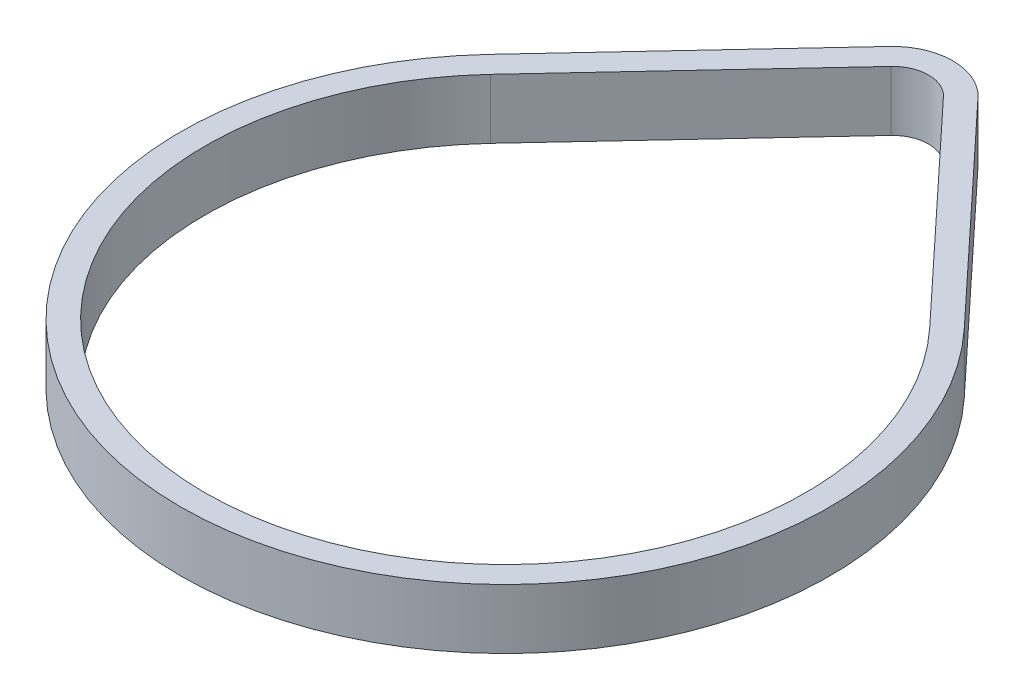
ISO-10303-21;
HEADER;
FILE_DESCRIPTION(('STEP AP214'),'2;1');
FILE_NAME('part.step','',(''),(''),'','','');
FILE_SCHEMA(('AUTOMOTIVE_DESIGN { 1 0 10303 214 1 1 1 1 }'));
ENDSEC;
DATA;
#1=APPLICATION_CONTEXT('core data for automotive mechanical design processes');
#2=APPLICATION_PROTOCOL_DEFINITION('international standard','automotive_design',2000,#1);
#3=PRODUCT_CONTEXT('',#1,'mechanical');
#4=PRODUCT('Part','Part','',(#3));
#5=PRODUCT_RELATED_PRODUCT_CATEGORY('part','',(#4));
#6=PRODUCT_DEFINITION_FORMATION('','',#4);
#7=PRODUCT_DEFINITION_CONTEXT('part definition',#1,'design');
#8=PRODUCT_DEFINITION('design','',#6,#7);
#9=PRODUCT_DEFINITION_SHAPE('','',#8);
#10=(LENGTH_UNIT() NAMED_UNIT(*) SI_UNIT(.MILLI.,.METRE.));
#11=(NAMED_UNIT(*) PLANE_ANGLE_UNIT() SI_UNIT($,.RADIAN.));
#12=(NAMED_UNIT(*) SI_UNIT($,.STERADIAN.) SOLID_ANGLE_UNIT());
#13=UNCERTAINTY_MEASURE_WITH_UNIT(LENGTH_MEASURE(1.E-05),#10,'distance_accuracy_value','');
#14=(GEOMETRIC_REPRESENTATION_CONTEXT(3) GLOBAL_UNCERTAINTY_ASSIGNED_CONTEXT((#13)) GLOBAL_UNIT_ASSIGNED_CONTEXT((#10,
#11,#12)) REPRESENTATION_CONTEXT('',''));
#15=CARTESIAN_POINT('',(0.,0.,0.));
#16=DIRECTION('',(0.,0.,1.));
#17=DIRECTION('',(1.,0.,0.));
#18=AXIS2_PLACEMENT_3D('',#15,#16,#17);
#19=CARTESIAN_POINT('',(0.,4.5,-58.3013119830021));
#20=DIRECTION('',(0.,1.,0.));
#21=DIRECTION('',(0.,0.,1.));
#22=AXIS2_PLACEMENT_3D('',#19,#20,#21);
#23=PLANE('',#22);
#24=CARTESIAN_POINT('',(0.,4.5,-58.3013119830021));
#25=DIRECTION('',(0.,1.,0.));
#26=DIRECTION('',(1.,0.,0.));
#27=AXIS2_PLACEMENT_3D('',#24,#25,#26);
#28=CIRCLE('',#27,9.1007472071159);
#29=CARTESIAN_POINT('',(6.65188338711861,4.5,-64.512273835405));
#30=VERTEX_POINT('',#29);
#31=CARTESIAN_POINT('',(-6.65188338711861,4.5,-64.512273835405));
#32=VERTEX_POINT('',#31);
#33=EDGE_CURVE('E117',#30,#32,#28,.T.);
#34=ORIENTED_EDGE('',*,*,#33,.T.);
#35=DIRECTION('',(-0.682467242639865,0.,0.730916180367859));
#36=VECTOR('',#35,1.);
#37=CARTESIAN_POINT('',(-6.65188338711861,4.5,-64.512273835405));
#38=LINE('',#37,#36);
#39=CARTESIAN_POINT('',(-35.7341140564339,4.5,-33.3654705468403));
#40=VERTEX_POINT('',#39);
#41=EDGE_CURVE('E120',#32,#40,#38,.T.);
#42=ORIENTED_EDGE('',*,*,#41,.T.);
#43=CARTESIAN_POINT('',(0.,4.5,0.));
#44=DIRECTION('',(0.,1.,0.));
#45=DIRECTION('',(1.,0.,0.));
#46=AXIS2_PLACEMENT_3D('',#43,#44,#45);
#47=CIRCLE('',#46,48.8894828384418);
#48=CARTESIAN_POINT('',(35.7341140564339,4.5,-33.3654705468403));
#49=VERTEX_POINT('',#48);
#50=EDGE_CURVE('E123',#40,#49,#47,.T.);
#51=ORIENTED_EDGE('',*,*,#50,.T.);
#52=DIRECTION('',(-0.682467242639864,0.,-0.730916180367859));
#53=VECTOR('',#52,1.);
#54=CARTESIAN_POINT('',(6.65188338711861,4.5,-64.512273835405));
#55=LINE('',#54,#53);
#56=EDGE_CURVE('E125',#49,#30,#55,.T.);
#57=ORIENTED_EDGE('',*,*,#56,.T.);
#58=EDGE_LOOP('',(#34,#42,#51,#57));
#59=FACE_BOUND('',#58,.T.);
#60=DIRECTION('',(-0.682467242639865,0.,0.730916180367859));
#61=VECTOR('',#60,1.);
#62=CARTESIAN_POINT('',(-3.95991909482379,4.5,-61.9987469807623));
#63=LINE('',#62,#61);
#64=CARTESIAN_POINT('',(-3.95991909482379,4.5,-61.9987469807623));
#65=VERTEX_POINT('',#64);
#66=CARTESIAN_POINT('',(-33.0421497641391,4.5,-30.8519436921978));
#67=VERTEX_POINT('',#66);
#68=EDGE_CURVE('E89',#65,#67,#63,.T.);
#69=ORIENTED_EDGE('',*,*,#68,.F.);
#70=CARTESIAN_POINT('',(0.,4.5,-58.3013119830021));
#71=DIRECTION('',(0.,1.,0.));
#72=DIRECTION('',(1.,0.,0.));
#73=AXIS2_PLACEMENT_3D('',#70,#71,#72);
#74=CIRCLE('',#73,5.4177472071159);
#75=CARTESIAN_POINT('',(3.95991909482378,4.5,-61.9987469807624));
#76=VERTEX_POINT('',#75);
#77=EDGE_CURVE('E81',#76,#65,#74,.T.);
#78=ORIENTED_EDGE('',*,*,#77,.F.);
#79=DIRECTION('',(-0.682467242639864,0.,-0.730916180367859));
#80=VECTOR('',#79,1.);
#81=CARTESIAN_POINT('',(3.95991909482378,4.5,-61.9987469807624));
#82=LINE('',#81,#80);
#83=CARTESIAN_POINT('',(33.0421497641391,4.5,-30.8519436921978));
#84=VERTEX_POINT('',#83);
#85=EDGE_CURVE('E103',#84,#76,#82,.T.);
#86=ORIENTED_EDGE('',*,*,#85,.F.);
#87=CARTESIAN_POINT('',(0.,4.5,0.));
#88=DIRECTION('',(0.,1.,0.));
#89=DIRECTION('',(1.,0.,0.));
#90=AXIS2_PLACEMENT_3D('',#87,#88,#89);
#91=CIRCLE('',#90,45.2064828384418);
#92=EDGE_CURVE('E101',#67,#84,#91,.T.);
#93=ORIENTED_EDGE('',*,*,#92,.F.);
#94=EDGE_LOOP('',(#69,#78,#86,#93));
#95=FACE_BOUND('',#94,.T.);
#96=ADVANCED_FACE('F16',(#59,#95),#23,.T.);
#97=CARTESIAN_POINT('',(0.,-4.5,-58.3013119830021));
#98=DIRECTION('',(0.,1.,0.));
#99=DIRECTION('',(0.,0.,1.));
#100=AXIS2_PLACEMENT_3D('',#97,#98,#99);
#101=PLANE('',#100);
#102=CARTESIAN_POINT('',(0.,-4.5,-58.3013119830021));
#103=DIRECTION('',(0.,1.,0.));
#104=DIRECTION('',(1.,0.,0.));
#105=AXIS2_PLACEMENT_3D('',#102,#103,#104);
#106=CIRCLE('',#105,9.1007472071159);
#107=CARTESIAN_POINT('',(6.65188338711861,-4.5,-64.512273835405));
#108=VERTEX_POINT('',#107);
#109=CARTESIAN_POINT('',(-6.65188338711861,-4.5,-64.512273835405));
#110=VERTEX_POINT('',#109);
#111=EDGE_CURVE('E97',#108,#110,#106,.T.);
#112=ORIENTED_EDGE('',*,*,#111,.F.);
#113=DIRECTION('',(-0.682467242639864,0.,-0.730916180367859));
#114=VECTOR('',#113,1.);
#115=CARTESIAN_POINT('',(6.65188338711861,-4.5,-64.512273835405));
#116=LINE('',#115,#114);
#117=CARTESIAN_POINT('',(35.7341140564339,-4.5,-33.3654705468403));
#118=VERTEX_POINT('',#117);
#119=EDGE_CURVE('E121',#118,#108,#116,.T.);
#120=ORIENTED_EDGE('',*,*,#119,.F.);
#121=CARTESIAN_POINT('',(0.,-4.5,0.));
#122=DIRECTION('',(0.,1.,0.));
#123=DIRECTION('',(1.,0.,0.));
#124=AXIS2_PLACEMENT_3D('',#121,#122,#123);
#125=CIRCLE('',#124,48.8894828384418);
#126=CARTESIAN_POINT('',(-35.7341140564339,-4.5,-33.3654705468403));
#127=VERTEX_POINT('',#126);
#128=EDGE_CURVE('E132',#127,#118,#125,.T.);
#129=ORIENTED_EDGE('',*,*,#128,.F.);
#130=DIRECTION('',(-0.682467242639865,0.,0.730916180367859));
#131=VECTOR('',#130,1.);
#132=CARTESIAN_POINT('',(-6.65188338711861,-4.5,-64.512273835405));
#133=LINE('',#132,#131);
#134=EDGE_CURVE('E130',#110,#127,#133,.T.);
#135=ORIENTED_EDGE('',*,*,#134,.F.);
#136=EDGE_LOOP('',(#112,#120,#129,#135));
#137=FACE_BOUND('',#136,.T.);
#138=CARTESIAN_POINT('',(0.,-4.5,-58.3013119830021));
#139=DIRECTION('',(0.,1.,0.));
#140=DIRECTION('',(1.,0.,0.));
#141=AXIS2_PLACEMENT_3D('',#138,#139,#140);
#142=CIRCLE('',#141,5.4177472071159);
#143=CARTESIAN_POINT('',(3.95991909482379,-4.5,-61.9987469807624));
#144=VERTEX_POINT('',#143);
#145=CARTESIAN_POINT('',(-3.95991909482379,-4.5,-61.9987469807623));
#146=VERTEX_POINT('',#145);
#147=EDGE_CURVE('E39',#144,#146,#142,.T.);
#148=ORIENTED_EDGE('',*,*,#147,.T.);
#149=DIRECTION('',(-0.682467242639865,0.,0.730916180367859));
#150=VECTOR('',#149,1.);
#151=CARTESIAN_POINT('',(-3.95991909482379,-4.5,-61.9987469807623));
#152=LINE('',#151,#150);
#153=CARTESIAN_POINT('',(-33.0421497641391,-4.5,-30.8519436921978));
#154=VERTEX_POINT('',#153);
#155=EDGE_CURVE('E96',#146,#154,#152,.T.);
#156=ORIENTED_EDGE('',*,*,#155,.T.);
#157=CARTESIAN_POINT('',(0.,-4.5,0.));
#158=DIRECTION('',(0.,1.,0.));
#159=DIRECTION('',(1.,0.,0.));
#160=AXIS2_PLACEMENT_3D('',#157,#158,#159);
#161=CIRCLE('',#160,45.2064828384418);
#162=CARTESIAN_POINT('',(33.0421497641391,-4.5,-30.8519436921978));
#163=VERTEX_POINT('',#162);
#164=EDGE_CURVE('E109',#154,#163,#161,.T.);
#165=ORIENTED_EDGE('',*,*,#164,.T.);
#166=DIRECTION('',(-0.682467242639864,0.,-0.730916180367859));
#167=VECTOR('',#166,1.);
#168=CARTESIAN_POINT('',(3.95991909482378,-4.5,-61.9987469807624));
#169=LINE('',#168,#167);
#170=EDGE_CURVE('E90',#163,#144,#169,.T.);
#171=ORIENTED_EDGE('',*,*,#170,.T.);
#172=EDGE_LOOP('',(#148,#156,#165,#171));
#173=FACE_BOUND('',#172,.T.);
#174=ADVANCED_FACE('F150',(#137,#173),#101,.F.);
#175=CARTESIAN_POINT('',(0.,4.5,-58.3013119830021));
#176=DIRECTION('',(0.,-1.,0.));
#177=DIRECTION('',(0.,0.,-1.));
#178=AXIS2_PLACEMENT_3D('',#175,#176,#177);
#179=CYLINDRICAL_SURFACE('',#178,9.1007472071159);
#180=ORIENTED_EDGE('',*,*,#111,.T.);
#181=DIRECTION('',(0.,-1.,0.));
#182=VECTOR('',#181,1.);
#183=CARTESIAN_POINT('',(-6.65188338711861,4.5,-64.512273835405));
#184=LINE('',#183,#182);
#185=EDGE_CURVE('E11',#32,#110,#184,.T.);
#186=ORIENTED_EDGE('',*,*,#185,.F.);
#187=ORIENTED_EDGE('',*,*,#33,.F.);
#188=DIRECTION('',(0.,-1.,0.));
#189=VECTOR('',#188,1.);
#190=CARTESIAN_POINT('',(6.65188338711861,4.5,-64.512273835405));
#191=LINE('',#190,#189);
#192=EDGE_CURVE('E127',#30,#108,#191,.T.);
#193=ORIENTED_EDGE('',*,*,#192,.T.);
#194=EDGE_LOOP('',(#180,#186,#187,#193));
#195=FACE_BOUND('',#194,.T.);
#196=ADVANCED_FACE('F18',(#195),#179,.T.);
#197=CARTESIAN_POINT('',(-6.65188338711861,4.5,-64.512273835405));
#198=DIRECTION('',(0.730916180367859,0.,0.682467242639864));
#199=DIRECTION('',(0.682467242639865,0.,-0.730916180367859));
#200=AXIS2_PLACEMENT_3D('',#197,#198,#199);
#201=PLANE('',#200);
#202=ORIENTED_EDGE('',*,*,#134,.T.);
#203=DIRECTION('',(0.,-1.,0.));
#204=VECTOR('',#203,1.);
#205=CARTESIAN_POINT('',(-35.7341140564339,4.5,-33.3654705468403));
#206=LINE('',#205,#204);
#207=EDGE_CURVE('E24',#40,#127,#206,.T.);
#208=ORIENTED_EDGE('',*,*,#207,.F.);
#209=ORIENTED_EDGE('',*,*,#41,.F.);
#210=ORIENTED_EDGE('',*,*,#185,.T.);
#211=EDGE_LOOP('',(#202,#208,#209,#210));
#212=FACE_BOUND('',#211,.T.);
#213=ADVANCED_FACE('F160',(#212),#201,.F.);
#214=CARTESIAN_POINT('',(0.,4.5,0.));
#215=DIRECTION('',(0.,-1.,0.));
#216=DIRECTION('',(0.,0.,-1.));
#217=AXIS2_PLACEMENT_3D('',#214,#215,#216);
#218=CYLINDRICAL_SURFACE('',#217,48.8894828384418);
#219=ORIENTED_EDGE('',*,*,#128,.T.);
#220=DIRECTION('',(0.,-1.,0.));
#221=VECTOR('',#220,1.);
#222=CARTESIAN_POINT('',(35.7341140564339,4.5,-33.3654705468403));
#223=LINE('',#222,#221);
#224=EDGE_CURVE('E137',#49,#118,#223,.T.);
#225=ORIENTED_EDGE('',*,*,#224,.F.);
#226=ORIENTED_EDGE('',*,*,#50,.F.);
#227=ORIENTED_EDGE('',*,*,#207,.T.);
#228=EDGE_LOOP('',(#219,#225,#226,#227));
#229=FACE_BOUND('',#228,.T.);
#230=ADVANCED_FACE('F144',(#229),#218,.T.);
#231=CARTESIAN_POINT('',(6.65188338711861,4.5,-64.512273835405));
#232=DIRECTION('',(-0.730916180367859,0.,0.682467242639864));
#233=DIRECTION('',(0.682467242639864,0.,0.730916180367859));
#234=AXIS2_PLACEMENT_3D('',#231,#232,#233);
#235=PLANE('',#234);
#236=ORIENTED_EDGE('',*,*,#119,.T.);
#237=ORIENTED_EDGE('',*,*,#192,.F.);
#238=ORIENTED_EDGE('',*,*,#56,.F.);
#239=ORIENTED_EDGE('',*,*,#224,.T.);
#240=EDGE_LOOP('',(#236,#237,#238,#239));
#241=FACE_BOUND('',#240,.T.);
#242=ADVANCED_FACE('F154',(#241),#235,.F.);
#243=CARTESIAN_POINT('',(0.,4.5,-58.3013119830021));
#244=DIRECTION('',(0.,-1.,0.));
#245=DIRECTION('',(0.,0.,-1.));
#246=AXIS2_PLACEMENT_3D('',#243,#244,#245);
#247=CYLINDRICAL_SURFACE('',#246,5.4177472071159);
#248=ORIENTED_EDGE('',*,*,#147,.F.);
#249=DIRECTION('',(0.,-1.,0.));
#250=VECTOR('',#249,1.);
#251=CARTESIAN_POINT('',(3.95991909482378,4.5,-61.9987469807624));
#252=LINE('',#251,#250);
#253=EDGE_CURVE('E85',#76,#144,#252,.T.);
#254=ORIENTED_EDGE('',*,*,#253,.F.);
#255=ORIENTED_EDGE('',*,*,#77,.T.);
#256=DIRECTION('',(0.,-1.,0.));
#257=VECTOR('',#256,1.);
#258=CARTESIAN_POINT('',(-3.95991909482379,4.5,-61.9987469807623));
#259=LINE('',#258,#257);
#260=EDGE_CURVE('E84',#65,#146,#259,.T.);
#261=ORIENTED_EDGE('',*,*,#260,.T.);
#262=EDGE_LOOP('',(#248,#254,#255,#261));
#263=FACE_BOUND('',#262,.T.);
#264=ADVANCED_FACE('F83',(#263),#247,.F.);
#265=CARTESIAN_POINT('',(-3.95991909482379,4.5,-61.9987469807623));
#266=DIRECTION('',(0.730916180367859,0.,0.682467242639864));
#267=DIRECTION('',(0.682467242639865,0.,-0.730916180367859));
#268=AXIS2_PLACEMENT_3D('',#265,#266,#267);
#269=PLANE('',#268);
#270=ORIENTED_EDGE('',*,*,#155,.F.);
#271=ORIENTED_EDGE('',*,*,#260,.F.);
#272=ORIENTED_EDGE('',*,*,#68,.T.);
#273=DIRECTION('',(0.,-1.,0.));
#274=VECTOR('',#273,1.);
#275=CARTESIAN_POINT('',(-33.0421497641391,4.5,-30.8519436921978));
#276=LINE('',#275,#274);
#277=EDGE_CURVE('E98',#67,#154,#276,.T.);
#278=ORIENTED_EDGE('',*,*,#277,.T.);
#279=EDGE_LOOP('',(#270,#271,#272,#278));
#280=FACE_BOUND('',#279,.T.);
#281=ADVANCED_FACE('F93',(#280),#269,.T.);
#282=CARTESIAN_POINT('',(0.,4.5,0.));
#283=DIRECTION('',(0.,-1.,0.));
#284=DIRECTION('',(0.,0.,-1.));
#285=AXIS2_PLACEMENT_3D('',#282,#283,#284);
#286=CYLINDRICAL_SURFACE('',#285,45.2064828384418);
#287=ORIENTED_EDGE('',*,*,#164,.F.);
#288=ORIENTED_EDGE('',*,*,#277,.F.);
#289=ORIENTED_EDGE('',*,*,#92,.T.);
#290=DIRECTION('',(0.,-1.,0.));
#291=VECTOR('',#290,1.);
#292=CARTESIAN_POINT('',(33.0421497641391,4.5,-30.8519436921978));
#293=LINE('',#292,#291);
#294=EDGE_CURVE('E31',#84,#163,#293,.T.);
#295=ORIENTED_EDGE('',*,*,#294,.T.);
#296=EDGE_LOOP('',(#287,#288,#289,#295));
#297=FACE_BOUND('',#296,.T.);
#298=ADVANCED_FACE('F188',(#297),#286,.F.);
#299=CARTESIAN_POINT('',(3.95991909482378,4.5,-61.9987469807624));
#300=DIRECTION('',(-0.730916180367859,0.,0.682467242639864));
#301=DIRECTION('',(0.682467242639864,0.,0.730916180367859));
#302=AXIS2_PLACEMENT_3D('',#299,#300,#301);
#303=PLANE('',#302);
#304=ORIENTED_EDGE('',*,*,#170,.F.);
#305=ORIENTED_EDGE('',*,*,#294,.F.);
#306=ORIENTED_EDGE('',*,*,#85,.T.);
#307=ORIENTED_EDGE('',*,*,#253,.T.);
#308=EDGE_LOOP('',(#304,#305,#306,#307));
#309=FACE_BOUND('',#308,.T.);
#310=ADVANCED_FACE('F193',(#309),#303,.T.);
#311=CLOSED_SHELL('',(#96,#174,#196,#213,#230,#242,#264,#281,#298,#310));
#312=MANIFOLD_SOLID_BREP('B1',#311);
#313=ADVANCED_BREP_SHAPE_REPRESENTATION('',(#18,#312),#14);
#314=SHAPE_DEFINITION_REPRESENTATION(#9,#313);
ENDSEC;
END-ISO-10303-21;
